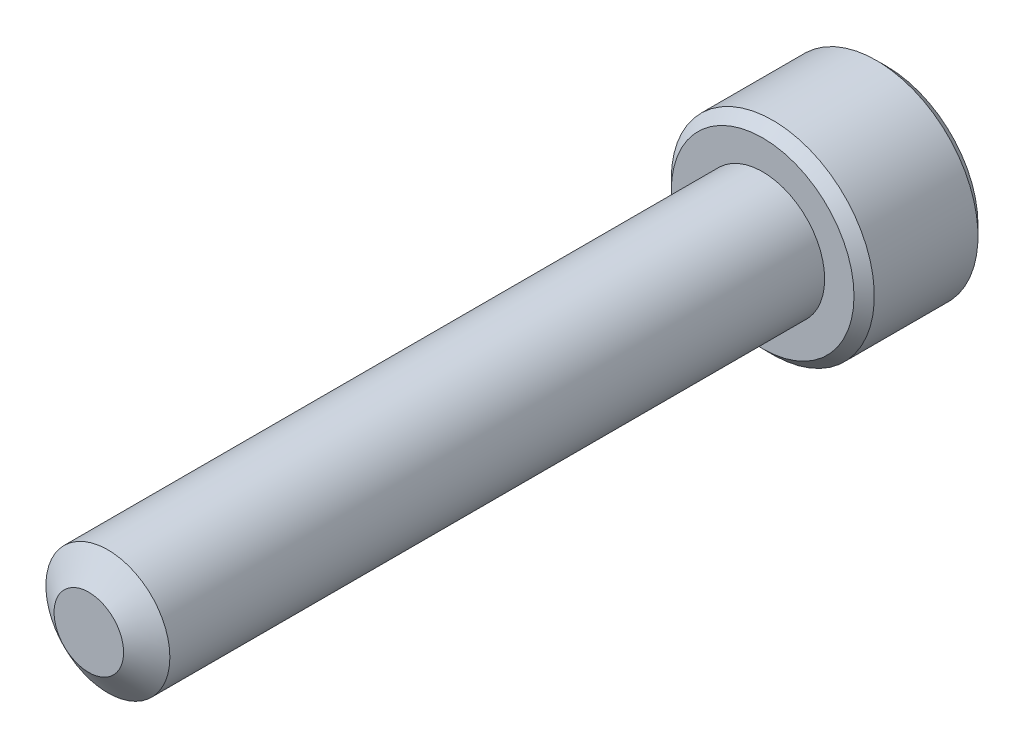
ISO-10303-21;
HEADER;
FILE_DESCRIPTION(('STEP AP214'),'2;1');
FILE_NAME('part.step','',(''),(''),'','','');
FILE_SCHEMA(('AUTOMOTIVE_DESIGN { 1 0 10303 214 1 1 1 1 }'));
ENDSEC;
DATA;
#1=APPLICATION_CONTEXT('core data for automotive mechanical design processes');
#2=APPLICATION_PROTOCOL_DEFINITION('international standard','automotive_design',2000,#1);
#3=PRODUCT_CONTEXT('',#1,'mechanical');
#4=PRODUCT('Part','Part','',(#3));
#5=PRODUCT_RELATED_PRODUCT_CATEGORY('part','',(#4));
#6=PRODUCT_DEFINITION_FORMATION('','',#4);
#7=PRODUCT_DEFINITION_CONTEXT('part definition',#1,'design');
#8=PRODUCT_DEFINITION('design','',#6,#7);
#9=PRODUCT_DEFINITION_SHAPE('','',#8);
#10=(LENGTH_UNIT() NAMED_UNIT(*) SI_UNIT(.MILLI.,.METRE.));
#11=(NAMED_UNIT(*) PLANE_ANGLE_UNIT() SI_UNIT($,.RADIAN.));
#12=(NAMED_UNIT(*) SI_UNIT($,.STERADIAN.) SOLID_ANGLE_UNIT());
#13=UNCERTAINTY_MEASURE_WITH_UNIT(LENGTH_MEASURE(1.E-05),#10,'distance_accuracy_value','');
#14=(GEOMETRIC_REPRESENTATION_CONTEXT(3) GLOBAL_UNCERTAINTY_ASSIGNED_CONTEXT((#13)) GLOBAL_UNIT_ASSIGNED_CONTEXT((#10,
#11,#12)) REPRESENTATION_CONTEXT('',''));
#15=CARTESIAN_POINT('',(0.,0.,0.));
#16=DIRECTION('',(0.,0.,1.));
#17=DIRECTION('',(1.,0.,0.));
#18=AXIS2_PLACEMENT_3D('',#15,#16,#17);
#19=CARTESIAN_POINT('',(0.,0.,-19.05));
#20=DIRECTION('',(0.,0.,1.));
#21=DIRECTION('',(1.,0.,0.));
#22=AXIS2_PLACEMENT_3D('',#19,#20,#21);
#23=CYLINDRICAL_SURFACE('',#22,1.7526);
#24=CARTESIAN_POINT('',(0.,0.,-19.05));
#25=DIRECTION('',(0.,0.,-1.));
#26=DIRECTION('',(-1.,0.,0.));
#27=AXIS2_PLACEMENT_3D('',#24,#25,#26);
#28=CIRCLE('',#27,1.7526);
#29=CARTESIAN_POINT('',(1.7526,0.,-19.05));
#30=VERTEX_POINT('',#29);
#31=EDGE_CURVE('E215',#30,#30,#28,.F.);
#32=CARTESIAN_POINT('',(0.,0.,-0.538848735955547));
#33=DIRECTION('',(0.,0.,1.));
#34=DIRECTION('',(1.,0.,0.));
#35=AXIS2_PLACEMENT_3D('',#32,#33,#34);
#36=CIRCLE('',#35,1.7526);
#37=CARTESIAN_POINT('',(1.7526,0.,-0.538848735955548));
#38=VERTEX_POINT('',#37);
#39=EDGE_CURVE('E109',#38,#38,#36,.T.);
#40=CARTESIAN_POINT('',(1.7526,0.,-19.05));
#41=CARTESIAN_POINT('',(1.7526,0.,-18.8571755076662));
#42=CARTESIAN_POINT('',(1.7526,0.,-18.6643510153324));
#43=CARTESIAN_POINT('',(1.7526,0.,-18.2787020306648));
#44=CARTESIAN_POINT('',(1.7526,0.,-18.085877538331));
#45=CARTESIAN_POINT('',(1.7526,0.,-17.7002285536634));
#46=CARTESIAN_POINT('',(1.7526,0.,-17.5074040613296));
#47=CARTESIAN_POINT('',(1.7526,0.,-17.121755076662));
#48=CARTESIAN_POINT('',(1.7526,0.,-16.9289305843282));
#49=CARTESIAN_POINT('',(1.7526,0.,-16.5432815996606));
#50=CARTESIAN_POINT('',(1.7526,0.,-16.3504571073269));
#51=CARTESIAN_POINT('',(1.7526,0.,-15.9648081226593));
#52=CARTESIAN_POINT('',(1.7526,0.,-15.7719836303255));
#53=CARTESIAN_POINT('',(1.7526,0.,-15.3863346456579));
#54=CARTESIAN_POINT('',(1.7526,0.,-15.1935101533241));
#55=CARTESIAN_POINT('',(1.7526,0.,-14.8078611686565));
#56=CARTESIAN_POINT('',(1.7526,0.,-14.6150366763227));
#57=CARTESIAN_POINT('',(1.7526,0.,-14.2293876916551));
#58=CARTESIAN_POINT('',(1.7526,0.,-14.0365631993213));
#59=CARTESIAN_POINT('',(1.7526,0.,-13.6509142146537));
#60=CARTESIAN_POINT('',(1.7526,0.,-13.4580897223199));
#61=CARTESIAN_POINT('',(1.7526,0.,-13.0724407376523));
#62=CARTESIAN_POINT('',(1.7526,0.,-12.8796162453185));
#63=CARTESIAN_POINT('',(1.7526,0.,-12.4939672606509));
#64=CARTESIAN_POINT('',(1.7526,0.,-12.3011427683171));
#65=CARTESIAN_POINT('',(1.7526,0.,-11.9154937836495));
#66=CARTESIAN_POINT('',(1.7526,0.,-11.7226692913157));
#67=CARTESIAN_POINT('',(1.7526,0.,-11.3370203066481));
#68=CARTESIAN_POINT('',(1.7526,0.,-11.1441958143143));
#69=CARTESIAN_POINT('',(1.7526,0.,-10.7585468296468));
#70=CARTESIAN_POINT('',(1.7526,0.,-10.565722337313));
#71=CARTESIAN_POINT('',(1.7526,0.,-10.1800733526454));
#72=CARTESIAN_POINT('',(1.7526,0.,-9.98724886031157));
#73=CARTESIAN_POINT('',(1.7526,0.,-9.60159987564398));
#74=CARTESIAN_POINT('',(1.7526,0.,-9.40877538331018));
#75=CARTESIAN_POINT('',(1.7526,0.,-9.02312639864259));
#76=CARTESIAN_POINT('',(1.7526,0.,-8.83030190630879));
#77=CARTESIAN_POINT('',(1.7526,0.,-8.4446529216412));
#78=CARTESIAN_POINT('',(1.7526,0.,-8.2518284293074));
#79=CARTESIAN_POINT('',(1.7526,0.,-7.86617944463981));
#80=CARTESIAN_POINT('',(1.7526,0.,-7.67335495230601));
#81=CARTESIAN_POINT('',(1.7526,0.,-7.28770596763842));
#82=CARTESIAN_POINT('',(1.7526,0.,-7.09488147530462));
#83=CARTESIAN_POINT('',(1.7526,0.,-6.70923249063703));
#84=CARTESIAN_POINT('',(1.7526,0.,-6.51640799830324));
#85=CARTESIAN_POINT('',(1.7526,0.,-6.13075901363564));
#86=CARTESIAN_POINT('',(1.7526,0.,-5.93793452130185));
#87=CARTESIAN_POINT('',(1.7526,0.,-5.55228553663425));
#88=CARTESIAN_POINT('',(1.7526,0.,-5.35946104430046));
#89=CARTESIAN_POINT('',(1.7526,0.,-4.97381205963287));
#90=CARTESIAN_POINT('',(1.7526,0.,-4.78098756729907));
#91=CARTESIAN_POINT('',(1.7526,0.,-4.39533858263148));
#92=CARTESIAN_POINT('',(1.7526,0.,-4.20251409029768));
#93=CARTESIAN_POINT('',(1.7526,0.,-3.81686510563009));
#94=CARTESIAN_POINT('',(1.7526,0.,-3.62404061329629));
#95=CARTESIAN_POINT('',(1.7526,0.,-3.2383916286287));
#96=CARTESIAN_POINT('',(1.7526,0.,-3.0455671362949));
#97=CARTESIAN_POINT('',(1.7526,0.,-2.65991815162731));
#98=CARTESIAN_POINT('',(1.7526,0.,-2.46709365929351));
#99=CARTESIAN_POINT('',(1.7526,0.,-2.08144467462592));
#100=CARTESIAN_POINT('',(1.7526,0.,-1.88862018229212));
#101=CARTESIAN_POINT('',(1.7526,0.,-1.50297119762453));
#102=CARTESIAN_POINT('',(1.7526,0.,-1.31014670529073));
#103=CARTESIAN_POINT('',(1.7526,0.,-0.924497720623141));
#104=CARTESIAN_POINT('',(1.7526,0.,-0.731673228289345));
#105=CARTESIAN_POINT('',(1.7526,0.,-0.538848735955548));
#106=B_SPLINE_CURVE_WITH_KNOTS('',3,(#40,#41,#42,#43,#44,#45,#46,#47,#48,#49,#50,#51,#52,#53,
#54,#55,#56,#57,#58,#59,#60,#61,#62,#63,#64,#65,#66,#67,#68,#69,#70,#71,#72,#73,#74,#75,#76,#77,
#78,#79,#80,#81,#82,#83,#84,#85,#86,#87,#88,#89,#90,#91,#92,#93,#94,#95,#96,#97,#98,#99,#100,
#101,#102,#103,#104,#105),.UNSPECIFIED.,.F.,.F.,(4,2,2,2,2,2,2,2,2,2,2,2,2,2,2,2,2,2,2,2,2,2,2,
2,2,2,2,2,2,2,2,2,4),(0.,0.578473477001386,1.15694695400278,1.73542043100416,2.31389390800555,
2.89236738500694,3.47084086200833,4.04931433900972,4.62778781601111,5.2062612930125,
5.78473477001389,6.36320824701528,6.94168172401667,7.52015520101806,8.09862867801944,
8.67710215502083,9.25557563202222,9.83404910902361,10.412522586025,10.9909960630264,
11.5694695400278,12.1479430170292,12.7264164940306,13.3048899710319,13.8833634480333,
14.4618369250347,15.0403104020361,15.6187838790375,16.1972573560389,16.7757308330403,
17.3542043100417,17.9326777870431,18.5111512640445),.UNSPECIFIED.);
#107=EDGE_CURVE('BSEAM35',#30,#38,#106,.T.);
#108=ORIENTED_EDGE('',*,*,#31,.T.);
#109=ORIENTED_EDGE('',*,*,#39,.F.);
#110=ORIENTED_EDGE('',*,*,#107,.T.);
#111=ORIENTED_EDGE('',*,*,#107,.F.);
#112=EDGE_LOOP('',(#108,#110,#109,#111));
#113=FACE_BOUND('',#112,.T.);
#114=ADVANCED_FACE('F35',(#113),#23,.T.);
#115=CARTESIAN_POINT('',(0.,0.,0.));
#116=DIRECTION('',(0.,0.,-1.));
#117=DIRECTION('',(-1.,0.,0.));
#118=AXIS2_PLACEMENT_3D('',#115,#116,#117);
#119=CONICAL_SURFACE('',#118,0.983044251809573,0.959931088596884);
#120=ORIENTED_EDGE('',*,*,#39,.T.);
#121=EDGE_LOOP('',(#120));
#122=FACE_BOUND('',#121,.T.);
#123=CARTESIAN_POINT('',(0.,0.,0.));
#124=DIRECTION('',(0.,0.,1.));
#125=DIRECTION('',(1.,0.,0.));
#126=AXIS2_PLACEMENT_3D('',#123,#124,#125);
#127=CIRCLE('',#126,0.983044251809573);
#128=CARTESIAN_POINT('',(0.983044251809573,0.,0.));
#129=VERTEX_POINT('',#128);
#130=EDGE_CURVE('E213',#129,#129,#127,.T.);
#131=ORIENTED_EDGE('',*,*,#130,.F.);
#132=EDGE_LOOP('',(#131));
#133=FACE_BOUND('',#132,.T.);
#134=ADVANCED_FACE('F196',(#122,#133),#119,.T.);
#135=CARTESIAN_POINT('',(0.,0.,0.));
#136=DIRECTION('',(0.,0.,1.));
#137=DIRECTION('',(1.,0.,0.));
#138=AXIS2_PLACEMENT_3D('',#135,#136,#137);
#139=PLANE('',#138);
#140=ORIENTED_EDGE('',*,*,#130,.T.);
#141=EDGE_LOOP('',(#140));
#142=FACE_BOUND('',#141,.T.);
#143=ADVANCED_FACE('F193',(#142),#139,.T.);
#144=CARTESIAN_POINT('',(0.,0.,-22.5552));
#145=DIRECTION('',(0.,0.,1.));
#146=DIRECTION('',(1.,0.,0.));
#147=AXIS2_PLACEMENT_3D('',#144,#145,#146);
#148=CYLINDRICAL_SURFACE('',#147,2.8702);
#149=CARTESIAN_POINT('',(0.,0.,-22.26818));
#150=DIRECTION('',(0.,0.,-1.));
#151=DIRECTION('',(-1.,0.,0.));
#152=AXIS2_PLACEMENT_3D('',#149,#150,#151);
#153=CIRCLE('',#152,2.8702);
#154=CARTESIAN_POINT('',(-2.8702,0.,-22.26818));
#155=VERTEX_POINT('',#154);
#156=EDGE_CURVE('E43',#155,#155,#153,.F.);
#157=ORIENTED_EDGE('',*,*,#156,.T.);
#158=EDGE_LOOP('',(#157));
#159=FACE_BOUND('',#158,.T.);
#160=CARTESIAN_POINT('',(0.,0.,-19.33702));
#161=DIRECTION('',(0.,0.,-1.));
#162=DIRECTION('',(-1.,0.,0.));
#163=AXIS2_PLACEMENT_3D('',#160,#161,#162);
#164=CIRCLE('',#163,2.8702);
#165=CARTESIAN_POINT('',(-2.8702,0.,-19.33702));
#166=VERTEX_POINT('',#165);
#167=EDGE_CURVE('E172',#166,#166,#164,.T.);
#168=ORIENTED_EDGE('',*,*,#167,.T.);
#169=EDGE_LOOP('',(#168));
#170=FACE_BOUND('',#169,.T.);
#171=ADVANCED_FACE('F177',(#159,#170),#148,.T.);
#172=CARTESIAN_POINT('',(0.,0.,-22.5552));
#173=DIRECTION('',(0.,0.,-1.));
#174=DIRECTION('',(-1.,0.,0.));
#175=AXIS2_PLACEMENT_3D('',#172,#173,#174);
#176=PLANE('',#175);
#177=CARTESIAN_POINT('',(0.,0.,-22.5552));
#178=DIRECTION('',(0.,0.,-1.));
#179=DIRECTION('',(-1.,0.,0.));
#180=AXIS2_PLACEMENT_3D('',#177,#178,#179);
#181=CIRCLE('',#180,2.58318);
#182=CARTESIAN_POINT('',(-2.58318,0.,-22.5552));
#183=VERTEX_POINT('',#182);
#184=EDGE_CURVE('E108',#183,#183,#181,.T.);
#185=ORIENTED_EDGE('',*,*,#184,.T.);
#186=EDGE_LOOP('',(#185));
#187=FACE_BOUND('',#186,.T.);
#188=CARTESIAN_POINT('',(0.,0.,-22.5552));
#189=DIRECTION('',(0.,0.,-1.));
#190=DIRECTION('',(-1.,0.,0.));
#191=AXIS2_PLACEMENT_3D('',#188,#189,#190);
#192=CIRCLE('',#191,1.60395121659243);
#193=CARTESIAN_POINT('',(-1.3890625,0.801975608296215,-22.5552));
#194=VERTEX_POINT('',#193);
#195=CARTESIAN_POINT('',(0.,1.60395121659243,-22.5552));
#196=VERTEX_POINT('',#195);
#197=EDGE_CURVE('E89',#194,#196,#192,.T.);
#198=ORIENTED_EDGE('',*,*,#197,.F.);
#199=CARTESIAN_POINT('',(-1.3890625,-0.801975608296215,-22.5552));
#200=VERTEX_POINT('',#199);
#201=EDGE_CURVE('E49',#200,#194,#192,.T.);
#202=ORIENTED_EDGE('',*,*,#201,.F.);
#203=CARTESIAN_POINT('',(0.,-1.60395121659243,-22.5552));
#204=VERTEX_POINT('',#203);
#205=EDGE_CURVE('E274',#204,#200,#192,.T.);
#206=ORIENTED_EDGE('',*,*,#205,.F.);
#207=CARTESIAN_POINT('',(1.3890625,-0.801975608296215,-22.5552));
#208=VERTEX_POINT('',#207);
#209=EDGE_CURVE('E56',#208,#204,#192,.T.);
#210=ORIENTED_EDGE('',*,*,#209,.F.);
#211=CARTESIAN_POINT('',(1.3890625,0.801975608296215,-22.5552));
#212=VERTEX_POINT('',#211);
#213=EDGE_CURVE('E130',#212,#208,#192,.T.);
#214=ORIENTED_EDGE('',*,*,#213,.F.);
#215=EDGE_CURVE('E98',#196,#212,#192,.T.);
#216=ORIENTED_EDGE('',*,*,#215,.F.);
#217=EDGE_LOOP('',(#198,#202,#206,#210,#214,#216));
#218=FACE_BOUND('',#217,.T.);
#219=ADVANCED_FACE('F129',(#187,#218),#176,.T.);
#220=CARTESIAN_POINT('',(0.,0.,-19.05));
#221=DIRECTION('',(0.,0.,-1.));
#222=DIRECTION('',(-1.,0.,0.));
#223=AXIS2_PLACEMENT_3D('',#220,#221,#222);
#224=PLANE('',#223);
#225=CARTESIAN_POINT('',(0.,0.,-19.05));
#226=DIRECTION('',(0.,0.,-1.));
#227=DIRECTION('',(-1.,0.,0.));
#228=AXIS2_PLACEMENT_3D('',#225,#226,#227);
#229=CIRCLE('',#228,2.58318);
#230=CARTESIAN_POINT('',(-2.58318,0.,-19.05));
#231=VERTEX_POINT('',#230);
#232=EDGE_CURVE('E11',#231,#231,#229,.F.);
#233=ORIENTED_EDGE('',*,*,#232,.T.);
#234=EDGE_LOOP('',(#233));
#235=FACE_BOUND('',#234,.T.);
#236=ORIENTED_EDGE('',*,*,#31,.F.);
#237=EDGE_LOOP('',(#236));
#238=FACE_BOUND('',#237,.T.);
#239=ADVANCED_FACE('F186',(#235,#238),#224,.F.);
#240=CARTESIAN_POINT('',(0.,0.,-22.5552));
#241=DIRECTION('',(0.,0.,-1.));
#242=DIRECTION('',(-1.,0.,0.));
#243=AXIS2_PLACEMENT_3D('',#240,#241,#242);
#244=CONICAL_SURFACE('',#243,1.60395121659243,0.78539816339745);
#245=ORIENTED_EDGE('',*,*,#215,.T.);
#246=CARTESIAN_POINT('',(-0.000200000000000453,1.60406668664627,-22.5553154825222));
#247=CARTESIAN_POINT('',(0.0475548148995852,1.57649543140889,-22.5277647868811));
#248=CARTESIAN_POINT('',(0.0961082129767671,1.54846311395896,-22.5018319141145));
#249=CARTESIAN_POINT('',(0.195114281423185,1.49130193369001,-22.4543489608708));
#250=CARTESIAN_POINT('',(0.245576372730142,1.46216763169007,-22.4328253080794));
#251=CARTESIAN_POINT('',(0.347330835284912,1.40341966534283,-22.3959546019866));
#252=CARTESIAN_POINT('',(0.398597278416377,1.37382097060048,-22.3805148513149));
#253=CARTESIAN_POINT('',(0.50225906912394,1.31397180783079,-22.3567264581829));
#254=CARTESIAN_POINT('',(0.554651247789434,1.28372316937484,-22.3483600517165));
#255=CARTESIAN_POINT('',(0.644944084544838,1.23159257576821,-22.3408113663708));
#256=CARTESIAN_POINT('',(0.682728034255603,1.20977800223165,-22.3396936971037));
#257=CARTESIAN_POINT('',(0.75822928780044,1.16618733317339,-22.3415750513552));
#258=CARTESIAN_POINT('',(0.795946575086521,1.14441124720567,-22.3445749834252));
#259=CARTESIAN_POINT('',(0.871018018906523,1.10106872890773,-22.3545189567457));
#260=CARTESIAN_POINT('',(0.908371804329556,1.07950251083849,-22.3614666704902));
#261=CARTESIAN_POINT('',(0.982452435596043,1.03673203843505,-22.3789288810594));
#262=CARTESIAN_POINT('',(1.01917900521513,1.01552794357906,-22.3894449088769));
#263=CARTESIAN_POINT('',(1.11325413716704,0.961213640822576,-22.4206664203823));
#264=CARTESIAN_POINT('',(1.17001916310317,0.928440337817794,-22.4437263608604));
#265=CARTESIAN_POINT('',(1.25348479270274,0.880251434100402,-22.4826547118295));
#266=CARTESIAN_POINT('',(1.28098915116073,0.86437178534079,-22.4963318145832));
#267=CARTESIAN_POINT('',(1.33549195495674,0.832904576897576,-22.5249348081189));
#268=CARTESIAN_POINT('',(1.36249063449213,0.817316882000055,-22.5398601023926));
#269=CARTESIAN_POINT('',(1.3892625,0.801860138242377,-22.5553154825221));
#270=B_SPLINE_CURVE_WITH_KNOTS('',3,(#246,#247,#248,#249,#250,#251,#252,#253,#254,#255,#256,
#257,#258,#259,#260,#261,#262,#263,#264,#265,#266,#267,#268,#269),.UNSPECIFIED.,.F.,.F.,(4,2,2,
2,2,2,2,2,2,2,2,4),(0.,0.185054161583334,0.37118697473197,0.554362620151556,0.737076859824677,
0.867821902366111,0.998595798526822,1.12949154907137,1.26044353188444,1.46846066168042,
1.57218026599104,1.67585058309997),.UNSPECIFIED.);
#271=EDGE_CURVE('E103',#196,#212,#270,.T.);
#272=ORIENTED_EDGE('',*,*,#271,.F.);
#273=EDGE_LOOP('',(#245,#272));
#274=FACE_BOUND('',#273,.T.);
#275=ADVANCED_FACE('F104',(#274),#244,.F.);
#276=ORIENTED_EDGE('',*,*,#213,.T.);
#277=CARTESIAN_POINT('',(1.3890625,-1.59946669533747,-23.0696888553473));
#278=CARTESIAN_POINT('',(1.3890625,-1.56052074100156,-23.0402883204447));
#279=CARTESIAN_POINT('',(1.3890625,-1.52135778101398,-23.0111760571059));
#280=CARTESIAN_POINT('',(1.3890625,-1.44250974368035,-22.9536471018554));
#281=CARTESIAN_POINT('',(1.3890625,-1.40282453775616,-22.9252305863579));
#282=CARTESIAN_POINT('',(1.3890625,-1.28227261747607,-22.8407979106091));
#283=CARTESIAN_POINT('',(1.3890625,-1.20050167441144,-22.7860513931364));
#284=CARTESIAN_POINT('',(1.3890625,-1.0290311937974,-22.6785774539605));
#285=CARTESIAN_POINT('',(1.3890625,-0.939145510476104,-22.6261436435155));
#286=CARTESIAN_POINT('',(1.3890625,-0.754884542278014,-22.5302310286316));
#287=CARTESIAN_POINT('',(1.3890625,-0.660525767721077,-22.4867220353823));
#288=CARTESIAN_POINT('',(1.3890625,-0.518892422901336,-22.4334928148428));
#289=CARTESIAN_POINT('',(1.3890625,-0.47371474679442,-22.4182156455446));
#290=CARTESIAN_POINT('',(1.3890625,-0.382268722235191,-22.3912883218985));
#291=CARTESIAN_POINT('',(1.3890625,-0.336000298881662,-22.3796384174186));
#292=CARTESIAN_POINT('',(1.3890625,-0.243422308835822,-22.3607647672582));
#293=CARTESIAN_POINT('',(1.3890625,-0.197128447486237,-22.3534651868372));
#294=CARTESIAN_POINT('',(1.3890625,-0.104045636784196,-22.343434703163));
#295=CARTESIAN_POINT('',(1.3890625,-0.057256773928491,-22.3407030145629));
#296=CARTESIAN_POINT('',(1.3890625,0.0346588401718116,-22.3400109514094));
#297=CARTESIAN_POINT('',(1.3890625,0.0797843745088201,-22.3418812460884));
#298=CARTESIAN_POINT('',(1.3890625,0.169653022605211,-22.3499168656859));
#299=CARTESIAN_POINT('',(1.3890625,0.214396061393215,-22.3560830139257));
#300=CARTESIAN_POINT('',(1.3890625,0.303926740576744,-22.3724783142406));
#301=CARTESIAN_POINT('',(1.3890625,0.34870156056264,-22.3827764230037));
#302=CARTESIAN_POINT('',(1.3890625,0.437272889801831,-22.4068883282636));
#303=CARTESIAN_POINT('',(1.3890625,0.481069480580728,-22.4207018305893));
#304=CARTESIAN_POINT('',(1.3890625,0.618958177531066,-22.4693885558667));
#305=CARTESIAN_POINT('',(1.3890625,0.711087679809603,-22.5098066296314));
#306=CARTESIAN_POINT('',(1.3890625,0.891018647016393,-22.5996712938188));
#307=CARTESIAN_POINT('',(1.3890625,0.978803075143677,-22.6491503209353));
#308=CARTESIAN_POINT('',(1.3890625,1.14657176186197,-22.7512299189673));
#309=CARTESIAN_POINT('',(1.3890625,1.22672686003424,-22.8035531888122));
#310=CARTESIAN_POINT('',(1.3890625,1.34481925924246,-22.8844395512885));
#311=CARTESIAN_POINT('',(1.3890625,1.3836737146102,-22.9116868720938));
#312=CARTESIAN_POINT('',(1.3890625,1.46085170378018,-22.9669021635328));
#313=CARTESIAN_POINT('',(1.3890625,1.49917537967343,-22.9948699353332));
#314=CARTESIAN_POINT('',(1.3890625,1.53727804285926,-23.0231364275532));
#315=B_SPLINE_CURVE_WITH_KNOTS('',3,(#277,#278,#279,#280,#281,#282,#283,#284,#285,#286,#287,
#288,#289,#290,#291,#292,#293,#294,#295,#296,#297,#298,#299,#300,#301,#302,#303,#304,#305,#306,
#307,#308,#309,#310,#311,#312,#313,#314),.UNSPECIFIED.,.F.,.F.,(4,2,2,2,2,2,2,2,2,2,2,2,2,2,2,2,
2,2,4),(0.,0.146388252251746,0.292813246205361,0.587897938676555,0.899825715593291,
1.21068031322194,1.35363178607713,1.49659310411811,1.63698331439609,1.77734938523477,
1.91262840625218,2.04793336128669,2.18559709790565,2.32324931849741,2.62418012481466,
2.92621005486572,3.2132312503121,3.35559422447358,3.49791832091463),.UNSPECIFIED.);
#316=EDGE_CURVE('E97',#212,#208,#315,.F.);
#317=ORIENTED_EDGE('',*,*,#316,.F.);
#318=EDGE_LOOP('',(#276,#317));
#319=FACE_BOUND('',#318,.T.);
#320=ADVANCED_FACE('F280',(#319),#244,.F.);
#321=ORIENTED_EDGE('',*,*,#209,.T.);
#322=CARTESIAN_POINT('',(1.3892625,-0.801860138242377,-22.5553154825221));
#323=CARTESIAN_POINT('',(1.34150768510041,-0.829431393479753,-22.527764786881));
#324=CARTESIAN_POINT('',(1.29295428702323,-0.857463710929685,-22.5018319141145));
#325=CARTESIAN_POINT('',(1.19394821857682,-0.91462489119863,-22.4543489608708));
#326=CARTESIAN_POINT('',(1.14348612726986,-0.943759193198573,-22.4328253080794));
#327=CARTESIAN_POINT('',(1.04173166471509,-1.00250715954581,-22.3959546019866));
#328=CARTESIAN_POINT('',(0.990465221583625,-1.03210585428816,-22.3805148513149));
#329=CARTESIAN_POINT('',(0.886803430876062,-1.09195501705785,-22.3567264581829));
#330=CARTESIAN_POINT('',(0.834411252210568,-1.12220365551381,-22.3483600517165));
#331=CARTESIAN_POINT('',(0.744118415455165,-1.17433424912043,-22.3408113663708));
#332=CARTESIAN_POINT('',(0.706334465744399,-1.19614882265699,-22.3396936971037));
#333=CARTESIAN_POINT('',(0.630833212199562,-1.23973949171526,-22.3415750513552));
#334=CARTESIAN_POINT('',(0.593115924913482,-1.26151557768298,-22.3445749834252));
#335=CARTESIAN_POINT('',(0.518044481093479,-1.30485809598091,-22.3545189567457));
#336=CARTESIAN_POINT('',(0.480690695670446,-1.32642431405015,-22.3614666704902));
#337=CARTESIAN_POINT('',(0.40661006440396,-1.36919478645359,-22.3789288810594));
#338=CARTESIAN_POINT('',(0.369883494784872,-1.39039888130958,-22.3894449088769));
#339=CARTESIAN_POINT('',(0.275808362832966,-1.44471318406607,-22.4206664203823));
#340=CARTESIAN_POINT('',(0.219043336896832,-1.47748648707085,-22.4437263608604));
#341=CARTESIAN_POINT('',(0.135577707297264,-1.52567539078824,-22.4826547118295));
#342=CARTESIAN_POINT('',(0.108073348839267,-1.54155503954785,-22.4963318145832));
#343=CARTESIAN_POINT('',(0.0535705450432605,-1.57302224799107,-22.5249348081189));
#344=CARTESIAN_POINT('',(0.0265718655078723,-1.58860994288859,-22.5398601023926));
#345=CARTESIAN_POINT('',(-0.000199999999999993,-1.60406668664627,-22.5553154825222));
#346=B_SPLINE_CURVE_WITH_KNOTS('',3,(#322,#323,#324,#325,#326,#327,#328,#329,#330,#331,#332,
#333,#334,#335,#336,#337,#338,#339,#340,#341,#342,#343,#344,#345),.UNSPECIFIED.,.F.,.F.,(4,2,2,
2,2,2,2,2,2,2,2,4),(0.,0.185054161583332,0.371186974731964,0.554362620151551,0.737076859824671,
0.867821902366106,0.998595798526816,1.12949154907136,1.26044353188444,1.46846066168042,
1.57218026599104,1.67585058309997),.UNSPECIFIED.);
#347=EDGE_CURVE('E140',#208,#204,#346,.T.);
#348=ORIENTED_EDGE('',*,*,#347,.F.);
#349=EDGE_LOOP('',(#321,#348));
#350=FACE_BOUND('',#349,.T.);
#351=ADVANCED_FACE('F277',(#350),#244,.F.);
#352=ORIENTED_EDGE('',*,*,#205,.T.);
#353=CARTESIAN_POINT('',(0.000200000000000837,-1.60406668664627,-22.5553154825222));
#354=CARTESIAN_POINT('',(-0.0475548148995849,-1.57649543140889,-22.5277647868811));
#355=CARTESIAN_POINT('',(-0.0961082129767669,-1.54846311395896,-22.5018319141145));
#356=CARTESIAN_POINT('',(-0.195114281423185,-1.49130193369001,-22.4543489608708));
#357=CARTESIAN_POINT('',(-0.245576372730142,-1.46216763169007,-22.4328253080794));
#358=CARTESIAN_POINT('',(-0.347330835284912,-1.40341966534283,-22.3959546019866));
#359=CARTESIAN_POINT('',(-0.398597278416378,-1.37382097060048,-22.3805148513149));
#360=CARTESIAN_POINT('',(-0.502259069123941,-1.31397180783079,-22.3567264581829));
#361=CARTESIAN_POINT('',(-0.554651247789435,-1.28372316937484,-22.3483600517165));
#362=CARTESIAN_POINT('',(-0.644944084544838,-1.23159257576821,-22.3408113663708));
#363=CARTESIAN_POINT('',(-0.682728034255604,-1.20977800223165,-22.3396936971037));
#364=CARTESIAN_POINT('',(-0.75822928780044,-1.16618733317339,-22.3415750513552));
#365=CARTESIAN_POINT('',(-0.795946575086521,-1.14441124720567,-22.3445749834252));
#366=CARTESIAN_POINT('',(-0.871018018906523,-1.10106872890773,-22.3545189567457));
#367=CARTESIAN_POINT('',(-0.908371804329557,-1.07950251083849,-22.3614666704902));
#368=CARTESIAN_POINT('',(-0.982452435596044,-1.03673203843505,-22.3789288810594));
#369=CARTESIAN_POINT('',(-1.01917900521513,-1.01552794357906,-22.3894449088769));
#370=CARTESIAN_POINT('',(-1.11325413716704,-0.961213640822575,-22.4206664203823));
#371=CARTESIAN_POINT('',(-1.17001916310317,-0.928440337817792,-22.4437263608604));
#372=CARTESIAN_POINT('',(-1.25348479270274,-0.880251434100401,-22.4826547118295));
#373=CARTESIAN_POINT('',(-1.28098915116073,-0.864371785340789,-22.4963318145832));
#374=CARTESIAN_POINT('',(-1.33549195495674,-0.832904576897576,-22.5249348081189));
#375=CARTESIAN_POINT('',(-1.36249063449213,-0.817316882000056,-22.5398601023926));
#376=CARTESIAN_POINT('',(-1.3892625,-0.801860138242377,-22.5553154825221));
#377=B_SPLINE_CURVE_WITH_KNOTS('',3,(#353,#354,#355,#356,#357,#358,#359,#360,#361,#362,#363,
#364,#365,#366,#367,#368,#369,#370,#371,#372,#373,#374,#375,#376),.UNSPECIFIED.,.F.,.F.,(4,2,2,
2,2,2,2,2,2,2,2,4),(0.,0.185054161583334,0.37118697473197,0.554362620151558,0.737076859824678,
0.867821902366112,0.998595798526823,1.12949154907137,1.26044353188445,1.46846066168042,
1.57218026599104,1.67585058309997),.UNSPECIFIED.);
#378=EDGE_CURVE('E251',#204,#200,#377,.T.);
#379=ORIENTED_EDGE('',*,*,#378,.F.);
#380=EDGE_LOOP('',(#352,#379));
#381=FACE_BOUND('',#380,.T.);
#382=ADVANCED_FACE('F276',(#381),#244,.F.);
#383=ORIENTED_EDGE('',*,*,#201,.T.);
#384=CARTESIAN_POINT('',(-1.3890625,-1.59946669533747,-23.0696888553473));
#385=CARTESIAN_POINT('',(-1.3890625,-1.56052074100156,-23.0402883204447));
#386=CARTESIAN_POINT('',(-1.3890625,-1.52135778101398,-23.0111760571059));
#387=CARTESIAN_POINT('',(-1.3890625,-1.44250974368035,-22.9536471018554));
#388=CARTESIAN_POINT('',(-1.3890625,-1.40282453775616,-22.9252305863579));
#389=CARTESIAN_POINT('',(-1.3890625,-1.28227261747607,-22.8407979106091));
#390=CARTESIAN_POINT('',(-1.3890625,-1.20050167441144,-22.7860513931364));
#391=CARTESIAN_POINT('',(-1.3890625,-1.0290311937974,-22.6785774539605));
#392=CARTESIAN_POINT('',(-1.3890625,-0.939145510476105,-22.6261436435155));
#393=CARTESIAN_POINT('',(-1.3890625,-0.754884542278015,-22.5302310286316));
#394=CARTESIAN_POINT('',(-1.3890625,-0.660525767721078,-22.4867220353823));
#395=CARTESIAN_POINT('',(-1.3890625,-0.518892422901337,-22.4334928148428));
#396=CARTESIAN_POINT('',(-1.3890625,-0.47371474679442,-22.4182156455446));
#397=CARTESIAN_POINT('',(-1.3890625,-0.382268722235192,-22.3912883218985));
#398=CARTESIAN_POINT('',(-1.3890625,-0.336000298881663,-22.3796384174186));
#399=CARTESIAN_POINT('',(-1.3890625,-0.243422308835823,-22.3607647672582));
#400=CARTESIAN_POINT('',(-1.3890625,-0.197128447486238,-22.3534651868372));
#401=CARTESIAN_POINT('',(-1.3890625,-0.104045636784196,-22.343434703163));
#402=CARTESIAN_POINT('',(-1.3890625,-0.0572567739284911,-22.3407030145629));
#403=CARTESIAN_POINT('',(-1.3890625,0.0346588401718115,-22.3400109514094));
#404=CARTESIAN_POINT('',(-1.3890625,0.0797843745088198,-22.3418812460884));
#405=CARTESIAN_POINT('',(-1.3890625,0.16965302260521,-22.3499168656859));
#406=CARTESIAN_POINT('',(-1.3890625,0.214396061393215,-22.3560830139257));
#407=CARTESIAN_POINT('',(-1.3890625,0.303926740576743,-22.3724783142406));
#408=CARTESIAN_POINT('',(-1.3890625,0.348701560562639,-22.3827764230037));
#409=CARTESIAN_POINT('',(-1.3890625,0.43727288980183,-22.4068883282636));
#410=CARTESIAN_POINT('',(-1.3890625,0.481069480580728,-22.4207018305893));
#411=CARTESIAN_POINT('',(-1.3890625,0.618958177531066,-22.4693885558667));
#412=CARTESIAN_POINT('',(-1.3890625,0.711087679809603,-22.5098066296314));
#413=CARTESIAN_POINT('',(-1.3890625,0.891018647016394,-22.5996712938188));
#414=CARTESIAN_POINT('',(-1.3890625,0.978803075143678,-22.6491503209353));
#415=CARTESIAN_POINT('',(-1.3890625,1.14657176186197,-22.7512299189673));
#416=CARTESIAN_POINT('',(-1.3890625,1.22672686003424,-22.8035531888122));
#417=CARTESIAN_POINT('',(-1.3890625,1.34481925924246,-22.8844395512885));
#418=CARTESIAN_POINT('',(-1.3890625,1.3836737146102,-22.9116868720938));
#419=CARTESIAN_POINT('',(-1.3890625,1.46085170378018,-22.9669021635328));
#420=CARTESIAN_POINT('',(-1.3890625,1.49917537967344,-22.9948699353332));
#421=CARTESIAN_POINT('',(-1.3890625,1.53727804285927,-23.0231364275532));
#422=B_SPLINE_CURVE_WITH_KNOTS('',3,(#384,#385,#386,#387,#388,#389,#390,#391,#392,#393,#394,
#395,#396,#397,#398,#399,#400,#401,#402,#403,#404,#405,#406,#407,#408,#409,#410,#411,#412,#413,
#414,#415,#416,#417,#418,#419,#420,#421),.UNSPECIFIED.,.F.,.F.,(4,2,2,2,2,2,2,2,2,2,2,2,2,2,2,2,
2,2,4),(0.,0.146388252251746,0.292813246205361,0.587897938676555,0.89982571559329,
1.21068031322194,1.35363178607713,1.4965931041181,1.63698331439609,1.77734938523477,
1.91262840625218,2.04793336128669,2.18559709790565,2.32324931849741,2.62418012481466,
2.92621005486573,3.2132312503121,3.35559422447358,3.49791832091464),.UNSPECIFIED.);
#423=EDGE_CURVE('E119',#200,#194,#422,.T.);
#424=ORIENTED_EDGE('',*,*,#423,.F.);
#425=EDGE_LOOP('',(#383,#424));
#426=FACE_BOUND('',#425,.T.);
#427=ADVANCED_FACE('F289',(#426),#244,.F.);
#428=ORIENTED_EDGE('',*,*,#197,.T.);
#429=CARTESIAN_POINT('',(-1.3892625,0.801860138242377,-22.5553154825221));
#430=CARTESIAN_POINT('',(-1.34150768510041,0.829431393479753,-22.5277647868811));
#431=CARTESIAN_POINT('',(-1.29295428702323,0.857463710929685,-22.5018319141145));
#432=CARTESIAN_POINT('',(-1.19394821857682,0.91462489119863,-22.4543489608708));
#433=CARTESIAN_POINT('',(-1.14348612726986,0.943759193198572,-22.4328253080794));
#434=CARTESIAN_POINT('',(-1.04173166471509,1.00250715954581,-22.3959546019866));
#435=CARTESIAN_POINT('',(-0.990465221583627,1.03210585428816,-22.3805148513149));
#436=CARTESIAN_POINT('',(-0.886803430876065,1.09195501705785,-22.3567264581829));
#437=CARTESIAN_POINT('',(-0.834411252210571,1.1222036555138,-22.3483600517165));
#438=CARTESIAN_POINT('',(-0.744118415455168,1.17433424912043,-22.3408113663708));
#439=CARTESIAN_POINT('',(-0.706334465744402,1.19614882265699,-22.3396936971037));
#440=CARTESIAN_POINT('',(-0.630833212199566,1.23973949171525,-22.3415750513552));
#441=CARTESIAN_POINT('',(-0.593115924913485,1.26151557768297,-22.3445749834252));
#442=CARTESIAN_POINT('',(-0.518044481093483,1.30485809598091,-22.3545189567457));
#443=CARTESIAN_POINT('',(-0.48069069567045,1.32642431405015,-22.3614666704902));
#444=CARTESIAN_POINT('',(-0.406610064403964,1.36919478645359,-22.3789288810594));
#445=CARTESIAN_POINT('',(-0.369883494784876,1.39039888130958,-22.3894449088769));
#446=CARTESIAN_POINT('',(-0.275808362832969,1.44471318406606,-22.4206664203823));
#447=CARTESIAN_POINT('',(-0.219043336896834,1.47748648707085,-22.4437263608604));
#448=CARTESIAN_POINT('',(-0.135577707297264,1.52567539078824,-22.4826547118294));
#449=CARTESIAN_POINT('',(-0.108073348839268,1.54155503954785,-22.4963318145832));
#450=CARTESIAN_POINT('',(-0.053570545043261,1.57302224799107,-22.5249348081189));
#451=CARTESIAN_POINT('',(-0.0265718655078723,1.58860994288859,-22.5398601023926));
#452=CARTESIAN_POINT('',(0.000200000000000667,1.60406668664627,-22.5553154825222));
#453=B_SPLINE_CURVE_WITH_KNOTS('',3,(#429,#430,#431,#432,#433,#434,#435,#436,#437,#438,#439,
#440,#441,#442,#443,#444,#445,#446,#447,#448,#449,#450,#451,#452),.UNSPECIFIED.,.F.,.F.,(4,2,2,
2,2,2,2,2,2,2,2,4),(0.,0.185054161583329,0.371186974731961,0.554362620151548,0.737076859824666,
0.867821902366101,0.998595798526811,1.12949154907136,1.26044353188443,1.46846066168042,
1.57218026599103,1.67585058309997),.UNSPECIFIED.);
#454=EDGE_CURVE('E93',#194,#196,#453,.T.);
#455=ORIENTED_EDGE('',*,*,#454,.F.);
#456=EDGE_LOOP('',(#428,#455));
#457=FACE_BOUND('',#456,.T.);
#458=ADVANCED_FACE('F91',(#457),#244,.F.);
#459=CARTESIAN_POINT('',(1.3890625,2.40592682488864,-20.47160625));
#460=DIRECTION('',(0.,0.,-1.));
#461=DIRECTION('',(-1.,0.,0.));
#462=AXIS2_PLACEMENT_3D('',#459,#460,#461);
#463=PLANE('',#462);
#464=DIRECTION('',(0.866025403784439,0.5,0.));
#465=VECTOR('',#464,1.);
#466=CARTESIAN_POINT('',(-1.3890625,0.801975608296215,-20.47160625));
#467=LINE('',#466,#465);
#468=CARTESIAN_POINT('',(-1.3890625,0.801975608296215,-20.47160625));
#469=VERTEX_POINT('',#468);
#470=CARTESIAN_POINT('',(0.,1.60395121659243,-20.47160625));
#471=VERTEX_POINT('',#470);
#472=EDGE_CURVE('E118',#469,#471,#467,.T.);
#473=ORIENTED_EDGE('',*,*,#472,.T.);
#474=DIRECTION('',(0.866025403784439,-0.5,0.));
#475=VECTOR('',#474,1.);
#476=CARTESIAN_POINT('',(0.,1.60395121659243,-20.47160625));
#477=LINE('',#476,#475);
#478=CARTESIAN_POINT('',(1.3890625,0.801975608296215,-20.47160625));
#479=VERTEX_POINT('',#478);
#480=EDGE_CURVE('E123',#471,#479,#477,.T.);
#481=ORIENTED_EDGE('',*,*,#480,.T.);
#482=DIRECTION('',(0.,-1.,0.));
#483=VECTOR('',#482,1.);
#484=CARTESIAN_POINT('',(1.3890625,0.801975608296215,-20.47160625));
#485=LINE('',#484,#483);
#486=CARTESIAN_POINT('',(1.3890625,-0.801975608296215,-20.47160625));
#487=VERTEX_POINT('',#486);
#488=EDGE_CURVE('E237',#479,#487,#485,.T.);
#489=ORIENTED_EDGE('',*,*,#488,.T.);
#490=DIRECTION('',(-0.866025403784438,-0.5,0.));
#491=VECTOR('',#490,1.);
#492=CARTESIAN_POINT('',(1.3890625,-0.801975608296215,-20.47160625));
#493=LINE('',#492,#491);
#494=CARTESIAN_POINT('',(0.,-1.60395121659243,-20.47160625));
#495=VERTEX_POINT('',#494);
#496=EDGE_CURVE('E234',#487,#495,#493,.T.);
#497=ORIENTED_EDGE('',*,*,#496,.T.);
#498=DIRECTION('',(-0.866025403784439,0.5,0.));
#499=VECTOR('',#498,1.);
#500=CARTESIAN_POINT('',(0.,-1.60395121659243,-20.47160625));
#501=LINE('',#500,#499);
#502=CARTESIAN_POINT('',(-1.3890625,-0.801975608296215,-20.47160625));
#503=VERTEX_POINT('',#502);
#504=EDGE_CURVE('E231',#495,#503,#501,.T.);
#505=ORIENTED_EDGE('',*,*,#504,.T.);
#506=DIRECTION('',(0.,1.,0.));
#507=VECTOR('',#506,1.);
#508=CARTESIAN_POINT('',(-1.3890625,-0.801975608296215,-20.47160625));
#509=LINE('',#508,#507);
#510=EDGE_CURVE('E126',#503,#469,#509,.T.);
#511=ORIENTED_EDGE('',*,*,#510,.T.);
#512=EDGE_LOOP('',(#473,#481,#489,#497,#505,#511));
#513=FACE_BOUND('',#512,.T.);
#514=ADVANCED_FACE('F160',(#513),#463,.T.);
#515=CARTESIAN_POINT('',(0.,1.60395121659243,-20.47160625));
#516=DIRECTION('',(0.5,0.866025403784439,0.));
#517=DIRECTION('',(-0.866025403784439,0.5,0.));
#518=AXIS2_PLACEMENT_3D('',#515,#516,#517);
#519=PLANE('',#518);
#520=DIRECTION('',(0.,0.,-1.));
#521=VECTOR('',#520,1.);
#522=CARTESIAN_POINT('',(0.,1.60395121659243,-20.47160625));
#523=LINE('',#522,#521);
#524=EDGE_CURVE('E115',#471,#196,#523,.T.);
#525=ORIENTED_EDGE('',*,*,#524,.T.);
#526=ORIENTED_EDGE('',*,*,#271,.T.);
#527=DIRECTION('',(0.,0.,-1.));
#528=VECTOR('',#527,1.);
#529=CARTESIAN_POINT('',(1.3890625,0.801975608296215,-20.47160625));
#530=LINE('',#529,#528);
#531=EDGE_CURVE('E125',#479,#212,#530,.T.);
#532=ORIENTED_EDGE('',*,*,#531,.F.);
#533=ORIENTED_EDGE('',*,*,#480,.F.);
#534=EDGE_LOOP('',(#525,#526,#532,#533));
#535=FACE_BOUND('',#534,.T.);
#536=ADVANCED_FACE('F121',(#535),#519,.F.);
#537=CARTESIAN_POINT('',(1.3890625,0.801975608296215,-20.47160625));
#538=DIRECTION('',(1.,0.,0.));
#539=DIRECTION('',(0.,1.,0.));
#540=AXIS2_PLACEMENT_3D('',#537,#538,#539);
#541=PLANE('',#540);
#542=ORIENTED_EDGE('',*,*,#531,.T.);
#543=ORIENTED_EDGE('',*,*,#316,.T.);
#544=DIRECTION('',(0.,0.,-1.));
#545=VECTOR('',#544,1.);
#546=CARTESIAN_POINT('',(1.3890625,-0.801975608296215,-20.47160625));
#547=LINE('',#546,#545);
#548=EDGE_CURVE('E220',#487,#208,#547,.T.);
#549=ORIENTED_EDGE('',*,*,#548,.F.);
#550=ORIENTED_EDGE('',*,*,#488,.F.);
#551=EDGE_LOOP('',(#542,#543,#549,#550));
#552=FACE_BOUND('',#551,.T.);
#553=ADVANCED_FACE('F149',(#552),#541,.F.);
#554=CARTESIAN_POINT('',(1.3890625,-0.801975608296215,-20.47160625));
#555=DIRECTION('',(0.5,-0.866025403784439,0.));
#556=DIRECTION('',(0.866025403784438,0.5,0.));
#557=AXIS2_PLACEMENT_3D('',#554,#555,#556);
#558=PLANE('',#557);
#559=ORIENTED_EDGE('',*,*,#548,.T.);
#560=ORIENTED_EDGE('',*,*,#347,.T.);
#561=DIRECTION('',(0.,0.,-1.));
#562=VECTOR('',#561,1.);
#563=CARTESIAN_POINT('',(0.,-1.60395121659243,-20.47160625));
#564=LINE('',#563,#562);
#565=EDGE_CURVE('E223',#495,#204,#564,.T.);
#566=ORIENTED_EDGE('',*,*,#565,.F.);
#567=ORIENTED_EDGE('',*,*,#496,.F.);
#568=EDGE_LOOP('',(#559,#560,#566,#567));
#569=FACE_BOUND('',#568,.T.);
#570=ADVANCED_FACE('F153',(#569),#558,.F.);
#571=CARTESIAN_POINT('',(0.,-1.60395121659243,-20.47160625));
#572=DIRECTION('',(-0.5,-0.866025403784439,0.));
#573=DIRECTION('',(0.866025403784439,-0.5,0.));
#574=AXIS2_PLACEMENT_3D('',#571,#572,#573);
#575=PLANE('',#574);
#576=ORIENTED_EDGE('',*,*,#565,.T.);
#577=ORIENTED_EDGE('',*,*,#378,.T.);
#578=DIRECTION('',(0.,0.,-1.));
#579=VECTOR('',#578,1.);
#580=CARTESIAN_POINT('',(-1.3890625,-0.801975608296215,-20.47160625));
#581=LINE('',#580,#579);
#582=EDGE_CURVE('E226',#503,#200,#581,.T.);
#583=ORIENTED_EDGE('',*,*,#582,.F.);
#584=ORIENTED_EDGE('',*,*,#504,.F.);
#585=EDGE_LOOP('',(#576,#577,#583,#584));
#586=FACE_BOUND('',#585,.T.);
#587=ADVANCED_FACE('F259',(#586),#575,.F.);
#588=CARTESIAN_POINT('',(-1.3890625,-0.801975608296215,-20.47160625));
#589=DIRECTION('',(-1.,0.,0.));
#590=DIRECTION('',(0.,-1.,0.));
#591=AXIS2_PLACEMENT_3D('',#588,#589,#590);
#592=PLANE('',#591);
#593=ORIENTED_EDGE('',*,*,#582,.T.);
#594=ORIENTED_EDGE('',*,*,#423,.T.);
#595=DIRECTION('',(0.,0.,-1.));
#596=VECTOR('',#595,1.);
#597=CARTESIAN_POINT('',(-1.3890625,0.801975608296215,-20.47160625));
#598=LINE('',#597,#596);
#599=EDGE_CURVE('E117',#469,#194,#598,.T.);
#600=ORIENTED_EDGE('',*,*,#599,.F.);
#601=ORIENTED_EDGE('',*,*,#510,.F.);
#602=EDGE_LOOP('',(#593,#594,#600,#601));
#603=FACE_BOUND('',#602,.T.);
#604=ADVANCED_FACE('F256',(#603),#592,.F.);
#605=CARTESIAN_POINT('',(-1.3890625,0.801975608296215,-20.47160625));
#606=DIRECTION('',(-0.5,0.866025403784439,0.));
#607=DIRECTION('',(-0.866025403784439,-0.5,0.));
#608=AXIS2_PLACEMENT_3D('',#605,#606,#607);
#609=PLANE('',#608);
#610=ORIENTED_EDGE('',*,*,#599,.T.);
#611=ORIENTED_EDGE('',*,*,#454,.T.);
#612=ORIENTED_EDGE('',*,*,#524,.F.);
#613=ORIENTED_EDGE('',*,*,#472,.F.);
#614=EDGE_LOOP('',(#610,#611,#612,#613));
#615=FACE_BOUND('',#614,.T.);
#616=ADVANCED_FACE('F113',(#615),#609,.F.);
#617=CARTESIAN_POINT('',(0.,0.,-22.5552));
#618=DIRECTION('',(0.,0.,1.));
#619=DIRECTION('',(1.,0.,0.));
#620=AXIS2_PLACEMENT_3D('',#617,#618,#619);
#621=CONICAL_SURFACE('',#620,2.58318,0.785398163397448);
#622=ORIENTED_EDGE('',*,*,#156,.F.);
#623=EDGE_LOOP('',(#622));
#624=FACE_BOUND('',#623,.T.);
#625=ORIENTED_EDGE('',*,*,#184,.F.);
#626=EDGE_LOOP('',(#625));
#627=FACE_BOUND('',#626,.T.);
#628=ADVANCED_FACE('F180',(#624,#627),#621,.T.);
#629=CARTESIAN_POINT('',(0.,0.,-19.33702));
#630=DIRECTION('',(0.,0.,-1.));
#631=DIRECTION('',(-1.,0.,0.));
#632=AXIS2_PLACEMENT_3D('',#629,#630,#631);
#633=CONICAL_SURFACE('',#632,2.8702,0.785398163397442);
#634=ORIENTED_EDGE('',*,*,#232,.F.);
#635=EDGE_LOOP('',(#634));
#636=FACE_BOUND('',#635,.T.);
#637=ORIENTED_EDGE('',*,*,#167,.F.);
#638=EDGE_LOOP('',(#637));
#639=FACE_BOUND('',#638,.T.);
#640=ADVANCED_FACE('F37',(#636,#639),#633,.T.);
#641=CLOSED_SHELL('',(#114,#134,#143,#171,#219,#239,#275,#320,#351,#382,#427,#458,#514,#536,
#553,#570,#587,#604,#616,#628,#640));
#642=MANIFOLD_SOLID_BREP('B2',#641);
#643=ADVANCED_BREP_SHAPE_REPRESENTATION('',(#18,#642),#14);
#644=SHAPE_DEFINITION_REPRESENTATION(#9,#643);
ENDSEC;
END-ISO-10303-21;
